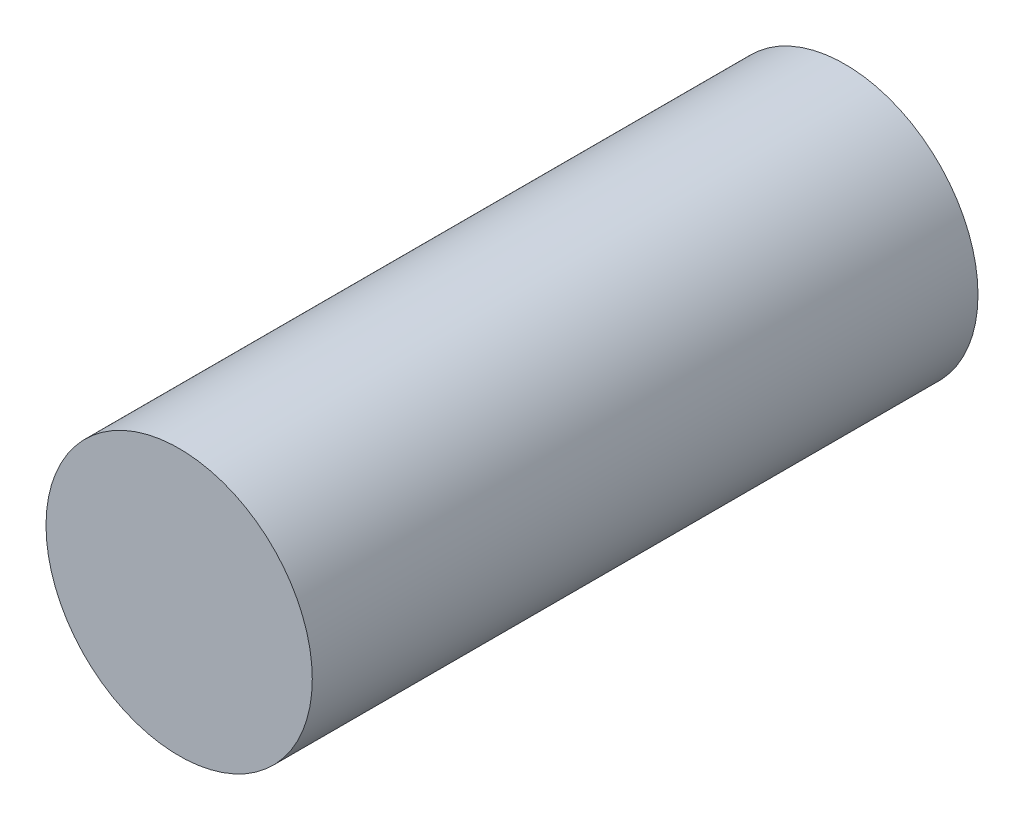
ISO-10303-21;
HEADER;
FILE_DESCRIPTION(('STEP AP214'),'2;1');
FILE_NAME('part.step','',(''),(''),'','','');
FILE_SCHEMA(('AUTOMOTIVE_DESIGN { 1 0 10303 214 1 1 1 1 }'));
ENDSEC;
DATA;
#1=APPLICATION_CONTEXT('core data for automotive mechanical design processes');
#2=APPLICATION_PROTOCOL_DEFINITION('international standard','automotive_design',2000,#1);
#3=PRODUCT_CONTEXT('',#1,'mechanical');
#4=PRODUCT('Part','Part','',(#3));
#5=PRODUCT_RELATED_PRODUCT_CATEGORY('part','',(#4));
#6=PRODUCT_DEFINITION_FORMATION('','',#4);
#7=PRODUCT_DEFINITION_CONTEXT('part definition',#1,'design');
#8=PRODUCT_DEFINITION('design','',#6,#7);
#9=PRODUCT_DEFINITION_SHAPE('','',#8);
#10=(LENGTH_UNIT() NAMED_UNIT(*) SI_UNIT(.MILLI.,.METRE.));
#11=(NAMED_UNIT(*) PLANE_ANGLE_UNIT() SI_UNIT($,.RADIAN.));
#12=(NAMED_UNIT(*) SI_UNIT($,.STERADIAN.) SOLID_ANGLE_UNIT());
#13=UNCERTAINTY_MEASURE_WITH_UNIT(LENGTH_MEASURE(1.E-05),#10,'distance_accuracy_value','');
#14=(GEOMETRIC_REPRESENTATION_CONTEXT(3) GLOBAL_UNCERTAINTY_ASSIGNED_CONTEXT((#13)) GLOBAL_UNIT_ASSIGNED_CONTEXT((#10,
#11,#12)) REPRESENTATION_CONTEXT('',''));
#15=CARTESIAN_POINT('',(0.,0.,0.));
#16=DIRECTION('',(0.,0.,1.));
#17=DIRECTION('',(1.,0.,0.));
#18=AXIS2_PLACEMENT_3D('',#15,#16,#17);
#19=CARTESIAN_POINT('',(0.,0.,20.));
#20=DIRECTION('',(0.,0.,-1.));
#21=DIRECTION('',(-1.,0.,0.));
#22=AXIS2_PLACEMENT_3D('',#19,#20,#21);
#23=CYLINDRICAL_SURFACE('',#22,4.);
#24=CARTESIAN_POINT('',(0.,0.,20.));
#25=DIRECTION('',(0.,0.,1.));
#26=DIRECTION('',(1.,0.,0.));
#27=AXIS2_PLACEMENT_3D('',#24,#25,#26);
#28=CIRCLE('',#27,4.);
#29=CARTESIAN_POINT('',(4.,0.,20.));
#30=VERTEX_POINT('',#29);
#31=EDGE_CURVE('E10',#30,#30,#28,.T.);
#32=ORIENTED_EDGE('',*,*,#31,.F.);
#33=EDGE_LOOP('',(#32));
#34=FACE_BOUND('',#33,.T.);
#35=CARTESIAN_POINT('',(0.,0.,0.));
#36=DIRECTION('',(0.,0.,1.));
#37=DIRECTION('',(1.,0.,0.));
#38=AXIS2_PLACEMENT_3D('',#35,#36,#37);
#39=CIRCLE('',#38,4.);
#40=CARTESIAN_POINT('',(4.,0.,0.));
#41=VERTEX_POINT('',#40);
#42=EDGE_CURVE('E38',#41,#41,#39,.T.);
#43=ORIENTED_EDGE('',*,*,#42,.T.);
#44=EDGE_LOOP('',(#43));
#45=FACE_BOUND('',#44,.T.);
#46=ADVANCED_FACE('F31',(#34,#45),#23,.T.);
#47=CARTESIAN_POINT('',(0.,0.,20.));
#48=DIRECTION('',(0.,0.,1.));
#49=DIRECTION('',(1.,0.,0.));
#50=AXIS2_PLACEMENT_3D('',#47,#48,#49);
#51=PLANE('',#50);
#52=ORIENTED_EDGE('',*,*,#31,.T.);
#53=EDGE_LOOP('',(#52));
#54=FACE_BOUND('',#53,.T.);
#55=ADVANCED_FACE('F73',(#54),#51,.T.);
#56=CARTESIAN_POINT('',(0.,0.,0.));
#57=DIRECTION('',(0.,0.,1.));
#58=DIRECTION('',(1.,0.,0.));
#59=AXIS2_PLACEMENT_3D('',#56,#57,#58);
#60=PLANE('',#59);
#61=CARTESIAN_POINT('',(0.,0.,0.));
#62=DIRECTION('',(0.,0.,-1.));
#63=DIRECTION('',(-1.,0.,0.));
#64=AXIS2_PLACEMENT_3D('',#61,#62,#63);
#65=CIRCLE('',#64,2.);
#66=CARTESIAN_POINT('',(-2.,0.,0.));
#67=VERTEX_POINT('',#66);
#68=EDGE_CURVE('E47',#67,#67,#65,.T.);
#69=ORIENTED_EDGE('',*,*,#68,.F.);
#70=EDGE_LOOP('',(#69));
#71=FACE_BOUND('',#70,.T.);
#72=ORIENTED_EDGE('',*,*,#42,.F.);
#73=EDGE_LOOP('',(#72));
#74=FACE_BOUND('',#73,.T.);
#75=ADVANCED_FACE('F78',(#71,#74),#60,.F.);
#76=CARTESIAN_POINT('',(0.,0.,5.));
#77=DIRECTION('',(0.,0.,-1.));
#78=DIRECTION('',(-1.,0.,0.));
#79=AXIS2_PLACEMENT_3D('',#76,#77,#78);
#80=PLANE('',#79);
#81=CARTESIAN_POINT('',(0.,0.,5.));
#82=DIRECTION('',(0.,0.,-1.));
#83=DIRECTION('',(-1.,0.,0.));
#84=AXIS2_PLACEMENT_3D('',#81,#82,#83);
#85=CIRCLE('',#84,2.);
#86=CARTESIAN_POINT('',(-2.,0.,5.));
#87=VERTEX_POINT('',#86);
#88=EDGE_CURVE('E50',#87,#87,#85,.T.);
#89=ORIENTED_EDGE('',*,*,#88,.T.);
#90=EDGE_LOOP('',(#89));
#91=FACE_BOUND('',#90,.T.);
#92=CARTESIAN_POINT('',(0.,0.,5.));
#93=DIRECTION('',(0.,0.,-1.));
#94=DIRECTION('',(-1.,0.,0.));
#95=AXIS2_PLACEMENT_3D('',#92,#93,#94);
#96=CIRCLE('',#95,1.75);
#97=CARTESIAN_POINT('',(-1.75,0.,5.));
#98=VERTEX_POINT('',#97);
#99=EDGE_CURVE('E34',#98,#98,#96,.F.);
#100=ORIENTED_EDGE('',*,*,#99,.T.);
#101=EDGE_LOOP('',(#100));
#102=FACE_BOUND('',#101,.T.);
#103=ADVANCED_FACE('F57',(#91,#102),#80,.T.);
#104=CARTESIAN_POINT('',(0.,0.,5.));
#105=DIRECTION('',(0.,0.,-1.));
#106=DIRECTION('',(-1.,0.,0.));
#107=AXIS2_PLACEMENT_3D('',#104,#105,#106);
#108=CYLINDRICAL_SURFACE('',#107,2.);
#109=ORIENTED_EDGE('',*,*,#88,.F.);
#110=EDGE_LOOP('',(#109));
#111=FACE_BOUND('',#110,.T.);
#112=ORIENTED_EDGE('',*,*,#68,.T.);
#113=EDGE_LOOP('',(#112));
#114=FACE_BOUND('',#113,.T.);
#115=ADVANCED_FACE('F67',(#111,#114),#108,.F.);
#116=CARTESIAN_POINT('',(0.,0.,10.));
#117=DIRECTION('',(0.,0.,-1.));
#118=DIRECTION('',(-1.,0.,0.));
#119=AXIS2_PLACEMENT_3D('',#116,#117,#118);
#120=PLANE('',#119);
#121=CARTESIAN_POINT('',(0.,0.,10.));
#122=DIRECTION('',(0.,0.,-1.));
#123=DIRECTION('',(-1.,0.,0.));
#124=AXIS2_PLACEMENT_3D('',#121,#122,#123);
#125=CIRCLE('',#124,1.75);
#126=CARTESIAN_POINT('',(-1.75,0.,10.));
#127=VERTEX_POINT('',#126);
#128=EDGE_CURVE('E43',#127,#127,#125,.T.);
#129=ORIENTED_EDGE('',*,*,#128,.T.);
#130=EDGE_LOOP('',(#129));
#131=FACE_BOUND('',#130,.T.);
#132=ADVANCED_FACE('F61',(#131),#120,.T.);
#133=CARTESIAN_POINT('',(0.,0.,10.));
#134=DIRECTION('',(0.,0.,-1.));
#135=DIRECTION('',(-1.,0.,0.));
#136=AXIS2_PLACEMENT_3D('',#133,#134,#135);
#137=CYLINDRICAL_SURFACE('',#136,1.75);
#138=ORIENTED_EDGE('',*,*,#128,.F.);
#139=EDGE_LOOP('',(#138));
#140=FACE_BOUND('',#139,.T.);
#141=ORIENTED_EDGE('',*,*,#99,.F.);
#142=EDGE_LOOP('',(#141));
#143=FACE_BOUND('',#142,.T.);
#144=ADVANCED_FACE('F59',(#140,#143),#137,.F.);
#145=CLOSED_SHELL('',(#46,#55,#75,#103,#115,#132,#144));
#146=MANIFOLD_SOLID_BREP('B2',#145);
#147=ADVANCED_BREP_SHAPE_REPRESENTATION('',(#18,#146),#14);
#148=SHAPE_DEFINITION_REPRESENTATION(#9,#147);
ENDSEC;
END-ISO-10303-21;
